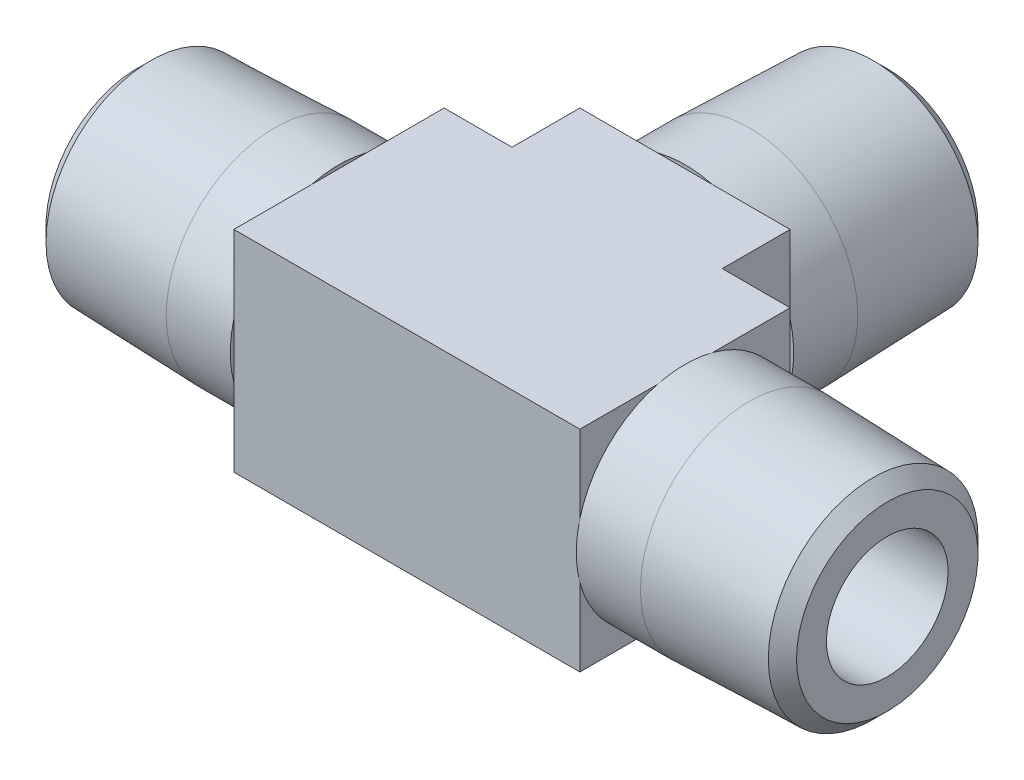
ISO-10303-21;
HEADER;
FILE_DESCRIPTION(('STEP AP214'),'2;1');
FILE_NAME('part.step','',(''),(''),'','','');
FILE_SCHEMA(('AUTOMOTIVE_DESIGN { 1 0 10303 214 1 1 1 1 }'));
ENDSEC;
DATA;
#1=APPLICATION_CONTEXT('core data for automotive mechanical design processes');
#2=APPLICATION_PROTOCOL_DEFINITION('international standard','automotive_design',2000,#1);
#3=PRODUCT_CONTEXT('',#1,'mechanical');
#4=PRODUCT('Part','Part','',(#3));
#5=PRODUCT_RELATED_PRODUCT_CATEGORY('part','',(#4));
#6=PRODUCT_DEFINITION_FORMATION('','',#4);
#7=PRODUCT_DEFINITION_CONTEXT('part definition',#1,'design');
#8=PRODUCT_DEFINITION('design','',#6,#7);
#9=PRODUCT_DEFINITION_SHAPE('','',#8);
#10=(LENGTH_UNIT() NAMED_UNIT(*) SI_UNIT(.MILLI.,.METRE.));
#11=(NAMED_UNIT(*) PLANE_ANGLE_UNIT() SI_UNIT($,.RADIAN.));
#12=(NAMED_UNIT(*) SI_UNIT($,.STERADIAN.) SOLID_ANGLE_UNIT());
#13=UNCERTAINTY_MEASURE_WITH_UNIT(LENGTH_MEASURE(1.E-05),#10,'distance_accuracy_value','');
#14=(GEOMETRIC_REPRESENTATION_CONTEXT(3) GLOBAL_UNCERTAINTY_ASSIGNED_CONTEXT((#13)) GLOBAL_UNIT_ASSIGNED_CONTEXT((#10,
#11,#12)) REPRESENTATION_CONTEXT('',''));
#15=CARTESIAN_POINT('',(0.,0.,0.));
#16=DIRECTION('',(0.,0.,1.));
#17=DIRECTION('',(1.,0.,0.));
#18=AXIS2_PLACEMENT_3D('',#15,#16,#17);
#19=CARTESIAN_POINT('',(26.51125,10.31875,0.));
#20=DIRECTION('',(-1.,0.,0.));
#21=DIRECTION('',(0.,0.,1.));
#22=AXIS2_PLACEMENT_3D('',#19,#20,#21);
#23=PLANE('',#22);
#24=DIRECTION('',(0.,1.,0.));
#25=VECTOR('',#24,1.);
#26=CARTESIAN_POINT('',(26.51125,10.31875,-10.31875));
#27=LINE('',#26,#25);
#28=CARTESIAN_POINT('',(26.51125,10.31875,-10.31875));
#29=VERTEX_POINT('',#28);
#30=CARTESIAN_POINT('',(26.51125,-10.31875,-10.31875));
#31=VERTEX_POINT('',#30);
#32=EDGE_CURVE('E131',#29,#31,#27,.F.);
#33=ORIENTED_EDGE('',*,*,#32,.F.);
#34=DIRECTION('',(0.,0.,1.));
#35=VECTOR('',#34,1.);
#36=CARTESIAN_POINT('',(26.51125,10.31875,10.31875));
#37=LINE('',#36,#35);
#38=CARTESIAN_POINT('',(26.51125,10.31875,-16.9799));
#39=VERTEX_POINT('',#38);
#40=EDGE_CURVE('E293',#39,#29,#37,.T.);
#41=ORIENTED_EDGE('',*,*,#40,.F.);
#42=DIRECTION('',(0.,1.,0.));
#43=VECTOR('',#42,1.);
#44=CARTESIAN_POINT('',(26.51125,0.,-16.9799));
#45=LINE('',#44,#43);
#46=CARTESIAN_POINT('',(26.51125,2.70732754529258,-16.9799));
#47=VERTEX_POINT('',#46);
#48=EDGE_CURVE('E124',#47,#39,#45,.T.);
#49=ORIENTED_EDGE('',*,*,#48,.F.);
#50=DIRECTION('',(0.,1.,0.));
#51=VECTOR('',#50,1.);
#52=CARTESIAN_POINT('',(26.51125,0.,-16.9799));
#53=LINE('',#52,#51);
#54=CARTESIAN_POINT('',(26.51125,-2.70732754529258,-16.9799));
#55=VERTEX_POINT('',#54);
#56=EDGE_CURVE('E305',#55,#47,#53,.T.);
#57=ORIENTED_EDGE('',*,*,#56,.F.);
#58=DIRECTION('',(0.,1.,0.));
#59=VECTOR('',#58,1.);
#60=CARTESIAN_POINT('',(26.51125,0.,-16.9799));
#61=LINE('',#60,#59);
#62=CARTESIAN_POINT('',(26.51125,-10.31875,-16.9799));
#63=VERTEX_POINT('',#62);
#64=EDGE_CURVE('E308',#63,#55,#61,.T.);
#65=ORIENTED_EDGE('',*,*,#64,.F.);
#66=DIRECTION('',(0.,0.,1.));
#67=VECTOR('',#66,1.);
#68=CARTESIAN_POINT('',(26.51125,-10.31875,-10.31875));
#69=LINE('',#68,#67);
#70=EDGE_CURVE('E292',#31,#63,#69,.F.);
#71=ORIENTED_EDGE('',*,*,#70,.F.);
#72=EDGE_LOOP('',(#33,#41,#49,#57,#65,#71));
#73=FACE_BOUND('',#72,.T.);
#74=ADVANCED_FACE('F17',(#73),#23,.T.);
#75=CARTESIAN_POINT('',(47.14875,-10.31875,0.));
#76=DIRECTION('',(1.,0.,0.));
#77=DIRECTION('',(0.,0.,-1.));
#78=AXIS2_PLACEMENT_3D('',#75,#76,#77);
#79=PLANE('',#78);
#80=DIRECTION('',(0.,1.,0.));
#81=VECTOR('',#80,1.);
#82=CARTESIAN_POINT('',(47.14875,0.,-16.9799));
#83=LINE('',#82,#81);
#84=CARTESIAN_POINT('',(47.14875,10.31875,-16.9799));
#85=VERTEX_POINT('',#84);
#86=CARTESIAN_POINT('',(47.14875,2.70732754529258,-16.9799));
#87=VERTEX_POINT('',#86);
#88=EDGE_CURVE('E162',#85,#87,#83,.F.);
#89=ORIENTED_EDGE('',*,*,#88,.F.);
#90=DIRECTION('',(0.,0.,1.));
#91=VECTOR('',#90,1.);
#92=CARTESIAN_POINT('',(47.14875,10.31875,10.31875));
#93=LINE('',#92,#91);
#94=CARTESIAN_POINT('',(47.14875,10.31875,-10.31875));
#95=VERTEX_POINT('',#94);
#96=EDGE_CURVE('E146',#95,#85,#93,.F.);
#97=ORIENTED_EDGE('',*,*,#96,.F.);
#98=DIRECTION('',(0.,1.,0.));
#99=VECTOR('',#98,1.);
#100=CARTESIAN_POINT('',(47.14875,10.31875,-10.31875));
#101=LINE('',#100,#99);
#102=CARTESIAN_POINT('',(47.14875,-10.31875,-10.31875));
#103=VERTEX_POINT('',#102);
#104=EDGE_CURVE('E275',#103,#95,#101,.T.);
#105=ORIENTED_EDGE('',*,*,#104,.F.);
#106=DIRECTION('',(0.,0.,1.));
#107=VECTOR('',#106,1.);
#108=CARTESIAN_POINT('',(47.14875,-10.31875,-10.31875));
#109=LINE('',#108,#107);
#110=CARTESIAN_POINT('',(47.14875,-10.31875,-16.9799));
#111=VERTEX_POINT('',#110);
#112=EDGE_CURVE('E286',#111,#103,#109,.T.);
#113=ORIENTED_EDGE('',*,*,#112,.F.);
#114=DIRECTION('',(0.,1.,0.));
#115=VECTOR('',#114,1.);
#116=CARTESIAN_POINT('',(47.14875,0.,-16.9799));
#117=LINE('',#116,#115);
#118=CARTESIAN_POINT('',(47.14875,-2.70732754529259,-16.9799));
#119=VERTEX_POINT('',#118);
#120=EDGE_CURVE('E310',#119,#111,#117,.F.);
#121=ORIENTED_EDGE('',*,*,#120,.F.);
#122=DIRECTION('',(0.,1.,0.));
#123=VECTOR('',#122,1.);
#124=CARTESIAN_POINT('',(47.14875,0.,-16.9799));
#125=LINE('',#124,#123);
#126=EDGE_CURVE('E165',#87,#119,#125,.F.);
#127=ORIENTED_EDGE('',*,*,#126,.F.);
#128=EDGE_LOOP('',(#89,#97,#105,#113,#121,#127));
#129=FACE_BOUND('',#128,.T.);
#130=ADVANCED_FACE('F163',(#129),#79,.T.);
#131=CARTESIAN_POINT('',(41.989375,0.,-16.9799));
#132=DIRECTION('',(0.,0.,-1.));
#133=DIRECTION('',(-1.,0.,0.));
#134=AXIS2_PLACEMENT_3D('',#131,#132,#133);
#135=PLANE('',#134);
#136=ORIENTED_EDGE('',*,*,#48,.T.);
#137=DIRECTION('',(-1.,0.,0.));
#138=VECTOR('',#137,1.);
#139=CARTESIAN_POINT('',(19.8501,10.31875,-16.9799));
#140=LINE('',#139,#138);
#141=CARTESIAN_POINT('',(34.1226724547074,10.31875,-16.9799));
#142=VERTEX_POINT('',#141);
#143=EDGE_CURVE('E173',#142,#39,#140,.T.);
#144=ORIENTED_EDGE('',*,*,#143,.F.);
#145=CARTESIAN_POINT('',(36.83,0.,-16.9799));
#146=DIRECTION('',(0.,0.,1.));
#147=DIRECTION('',(1.,0.,0.));
#148=AXIS2_PLACEMENT_3D('',#145,#146,#147);
#149=CIRCLE('',#148,10.668);
#150=EDGE_CURVE('E20',#47,#142,#149,.F.);
#151=ORIENTED_EDGE('',*,*,#150,.F.);
#152=EDGE_LOOP('',(#136,#144,#151));
#153=FACE_BOUND('',#152,.T.);
#154=ADVANCED_FACE('F985',(#153),#135,.T.);
#155=CARTESIAN_POINT('',(31.496,0.,-16.9799));
#156=DIRECTION('',(0.,0.,1.));
#157=DIRECTION('',(1.,0.,0.));
#158=AXIS2_PLACEMENT_3D('',#155,#156,#157);
#159=PLANE('',#158);
#160=DIRECTION('',(-1.,0.,0.));
#161=VECTOR('',#160,1.);
#162=CARTESIAN_POINT('',(19.8501,10.31875,-16.9799));
#163=LINE('',#162,#161);
#164=CARTESIAN_POINT('',(39.5373275452926,10.31875,-16.9799));
#165=VERTEX_POINT('',#164);
#166=EDGE_CURVE('E116',#165,#142,#163,.T.);
#167=ORIENTED_EDGE('',*,*,#166,.F.);
#168=CARTESIAN_POINT('',(36.83,0.,-16.9799));
#169=DIRECTION('',(0.,0.,1.));
#170=DIRECTION('',(1.,0.,0.));
#171=AXIS2_PLACEMENT_3D('',#168,#169,#170);
#172=CIRCLE('',#171,10.668);
#173=EDGE_CURVE('E265',#142,#165,#172,.F.);
#174=ORIENTED_EDGE('',*,*,#173,.F.);
#175=EDGE_LOOP('',(#167,#174));
#176=FACE_BOUND('',#175,.T.);
#177=ADVANCED_FACE('F989',(#176),#159,.T.);
#178=CARTESIAN_POINT('',(41.989375,0.,-16.9799));
#179=DIRECTION('',(0.,0.,-1.));
#180=DIRECTION('',(-1.,0.,0.));
#181=AXIS2_PLACEMENT_3D('',#178,#179,#180);
#182=PLANE('',#181);
#183=DIRECTION('',(-1.,0.,0.));
#184=VECTOR('',#183,1.);
#185=CARTESIAN_POINT('',(19.8501,10.31875,-16.9799));
#186=LINE('',#185,#184);
#187=EDGE_CURVE('E150',#85,#165,#186,.T.);
#188=ORIENTED_EDGE('',*,*,#187,.F.);
#189=ORIENTED_EDGE('',*,*,#88,.T.);
#190=CARTESIAN_POINT('',(36.83,0.,-16.9799));
#191=DIRECTION('',(0.,0.,1.));
#192=DIRECTION('',(1.,0.,0.));
#193=AXIS2_PLACEMENT_3D('',#190,#191,#192);
#194=CIRCLE('',#193,10.668);
#195=EDGE_CURVE('E170',#165,#87,#194,.F.);
#196=ORIENTED_EDGE('',*,*,#195,.F.);
#197=EDGE_LOOP('',(#188,#189,#196));
#198=FACE_BOUND('',#197,.T.);
#199=ADVANCED_FACE('F169',(#198),#182,.T.);
#200=CARTESIAN_POINT('',(31.496,0.,-16.9799));
#201=DIRECTION('',(0.,0.,1.));
#202=DIRECTION('',(1.,0.,0.));
#203=AXIS2_PLACEMENT_3D('',#200,#201,#202);
#204=PLANE('',#203);
#205=CARTESIAN_POINT('',(36.83,0.,-16.9799));
#206=DIRECTION('',(0.,0.,1.));
#207=DIRECTION('',(1.,0.,0.));
#208=AXIS2_PLACEMENT_3D('',#205,#206,#207);
#209=CIRCLE('',#208,10.668);
#210=EDGE_CURVE('E262',#87,#119,#209,.F.);
#211=ORIENTED_EDGE('',*,*,#210,.F.);
#212=ORIENTED_EDGE('',*,*,#126,.T.);
#213=EDGE_LOOP('',(#211,#212));
#214=FACE_BOUND('',#213,.T.);
#215=ADVANCED_FACE('F667',(#214),#204,.T.);
#216=CARTESIAN_POINT('',(41.989375,0.,-16.9799));
#217=DIRECTION('',(0.,0.,-1.));
#218=DIRECTION('',(-1.,0.,0.));
#219=AXIS2_PLACEMENT_3D('',#216,#217,#218);
#220=PLANE('',#219);
#221=ORIENTED_EDGE('',*,*,#120,.T.);
#222=DIRECTION('',(1.,0.,0.));
#223=VECTOR('',#222,1.);
#224=CARTESIAN_POINT('',(19.8501,-10.31875,-16.9799));
#225=LINE('',#224,#223);
#226=CARTESIAN_POINT('',(39.5373275452926,-10.31875,-16.9799));
#227=VERTEX_POINT('',#226);
#228=EDGE_CURVE('E324',#227,#111,#225,.T.);
#229=ORIENTED_EDGE('',*,*,#228,.F.);
#230=CARTESIAN_POINT('',(36.83,0.,-16.9799));
#231=DIRECTION('',(0.,0.,1.));
#232=DIRECTION('',(1.,0.,0.));
#233=AXIS2_PLACEMENT_3D('',#230,#231,#232);
#234=CIRCLE('',#233,10.668);
#235=EDGE_CURVE('E259',#119,#227,#234,.F.);
#236=ORIENTED_EDGE('',*,*,#235,.F.);
#237=EDGE_LOOP('',(#221,#229,#236));
#238=FACE_BOUND('',#237,.T.);
#239=ADVANCED_FACE('F671',(#238),#220,.T.);
#240=CARTESIAN_POINT('',(31.496,0.,-16.9799));
#241=DIRECTION('',(0.,0.,1.));
#242=DIRECTION('',(1.,0.,0.));
#243=AXIS2_PLACEMENT_3D('',#240,#241,#242);
#244=PLANE('',#243);
#245=DIRECTION('',(1.,0.,0.));
#246=VECTOR('',#245,1.);
#247=CARTESIAN_POINT('',(19.8501,-10.31875,-16.9799));
#248=LINE('',#247,#246);
#249=CARTESIAN_POINT('',(34.1226724547074,-10.31875,-16.9799));
#250=VERTEX_POINT('',#249);
#251=EDGE_CURVE('E341',#250,#227,#248,.T.);
#252=ORIENTED_EDGE('',*,*,#251,.F.);
#253=CARTESIAN_POINT('',(36.83,0.,-16.9799));
#254=DIRECTION('',(0.,0.,1.));
#255=DIRECTION('',(1.,0.,0.));
#256=AXIS2_PLACEMENT_3D('',#253,#254,#255);
#257=CIRCLE('',#256,10.668);
#258=EDGE_CURVE('E256',#227,#250,#257,.F.);
#259=ORIENTED_EDGE('',*,*,#258,.F.);
#260=EDGE_LOOP('',(#252,#259));
#261=FACE_BOUND('',#260,.T.);
#262=ADVANCED_FACE('F732',(#261),#244,.T.);
#263=CARTESIAN_POINT('',(41.989375,0.,-16.9799));
#264=DIRECTION('',(0.,0.,-1.));
#265=DIRECTION('',(-1.,0.,0.));
#266=AXIS2_PLACEMENT_3D('',#263,#264,#265);
#267=PLANE('',#266);
#268=DIRECTION('',(1.,0.,0.));
#269=VECTOR('',#268,1.);
#270=CARTESIAN_POINT('',(19.8501,-10.31875,-16.9799));
#271=LINE('',#270,#269);
#272=EDGE_CURVE('E336',#63,#250,#271,.T.);
#273=ORIENTED_EDGE('',*,*,#272,.F.);
#274=ORIENTED_EDGE('',*,*,#64,.T.);
#275=CARTESIAN_POINT('',(36.83,0.,-16.9799));
#276=DIRECTION('',(0.,0.,1.));
#277=DIRECTION('',(1.,0.,0.));
#278=AXIS2_PLACEMENT_3D('',#275,#276,#277);
#279=CIRCLE('',#278,10.668);
#280=EDGE_CURVE('E253',#250,#55,#279,.F.);
#281=ORIENTED_EDGE('',*,*,#280,.F.);
#282=EDGE_LOOP('',(#273,#274,#281));
#283=FACE_BOUND('',#282,.T.);
#284=ADVANCED_FACE('F727',(#283),#267,.T.);
#285=CARTESIAN_POINT('',(31.496,0.,-16.9799));
#286=DIRECTION('',(0.,0.,1.));
#287=DIRECTION('',(1.,0.,0.));
#288=AXIS2_PLACEMENT_3D('',#285,#286,#287);
#289=PLANE('',#288);
#290=ORIENTED_EDGE('',*,*,#56,.T.);
#291=CARTESIAN_POINT('',(36.83,0.,-16.9799));
#292=DIRECTION('',(0.,0.,1.));
#293=DIRECTION('',(1.,0.,0.));
#294=AXIS2_PLACEMENT_3D('',#291,#292,#293);
#295=CIRCLE('',#294,10.668);
#296=EDGE_CURVE('E249',#55,#47,#295,.F.);
#297=ORIENTED_EDGE('',*,*,#296,.F.);
#298=EDGE_LOOP('',(#290,#297));
#299=FACE_BOUND('',#298,.T.);
#300=ADVANCED_FACE('F731',(#299),#289,.T.);
#301=CARTESIAN_POINT('',(19.8501,10.31875,-10.31875));
#302=DIRECTION('',(0.,0.,-1.));
#303=DIRECTION('',(-1.,0.,0.));
#304=AXIS2_PLACEMENT_3D('',#301,#302,#303);
#305=PLANE('',#304);
#306=DIRECTION('',(0.,1.,0.));
#307=VECTOR('',#306,1.);
#308=CARTESIAN_POINT('',(19.8501,0.,-10.31875));
#309=LINE('',#308,#307);
#310=CARTESIAN_POINT('',(19.8501,10.31875,-10.31875));
#311=VERTEX_POINT('',#310);
#312=CARTESIAN_POINT('',(19.8501,2.70732754529258,-10.31875));
#313=VERTEX_POINT('',#312);
#314=EDGE_CURVE('E359',#311,#313,#309,.F.);
#315=ORIENTED_EDGE('',*,*,#314,.F.);
#316=DIRECTION('',(-1.,0.,0.));
#317=VECTOR('',#316,1.);
#318=CARTESIAN_POINT('',(19.8501,10.31875,-10.31875));
#319=LINE('',#318,#317);
#320=EDGE_CURVE('E158',#29,#311,#319,.T.);
#321=ORIENTED_EDGE('',*,*,#320,.F.);
#322=ORIENTED_EDGE('',*,*,#32,.T.);
#323=DIRECTION('',(1.,0.,0.));
#324=VECTOR('',#323,1.);
#325=CARTESIAN_POINT('',(19.8501,-10.31875,-10.31875));
#326=LINE('',#325,#324);
#327=CARTESIAN_POINT('',(19.8501,-10.31875,-10.31875));
#328=VERTEX_POINT('',#327);
#329=EDGE_CURVE('E285',#328,#31,#326,.T.);
#330=ORIENTED_EDGE('',*,*,#329,.F.);
#331=DIRECTION('',(0.,1.,0.));
#332=VECTOR('',#331,1.);
#333=CARTESIAN_POINT('',(19.8501,0.,-10.31875));
#334=LINE('',#333,#332);
#335=CARTESIAN_POINT('',(19.8501,-2.70732754529259,-10.31875));
#336=VERTEX_POINT('',#335);
#337=EDGE_CURVE('E367',#336,#328,#334,.F.);
#338=ORIENTED_EDGE('',*,*,#337,.F.);
#339=DIRECTION('',(0.,1.,0.));
#340=VECTOR('',#339,1.);
#341=CARTESIAN_POINT('',(19.8501,0.,-10.31875));
#342=LINE('',#341,#340);
#343=EDGE_CURVE('E361',#313,#336,#342,.F.);
#344=ORIENTED_EDGE('',*,*,#343,.F.);
#345=EDGE_LOOP('',(#315,#321,#322,#330,#338,#344));
#346=FACE_BOUND('',#345,.T.);
#347=ADVANCED_FACE('F356',(#346),#305,.T.);
#348=CARTESIAN_POINT('',(19.8501,10.31875,10.31875));
#349=DIRECTION('',(0.,1.,0.));
#350=DIRECTION('',(-1.,0.,0.));
#351=AXIS2_PLACEMENT_3D('',#348,#349,#350);
#352=PLANE('',#351);
#353=ORIENTED_EDGE('',*,*,#143,.T.);
#354=ORIENTED_EDGE('',*,*,#40,.T.);
#355=ORIENTED_EDGE('',*,*,#320,.T.);
#356=DIRECTION('',(0.,0.,1.));
#357=VECTOR('',#356,1.);
#358=CARTESIAN_POINT('',(19.8501,10.31875,-5.159375));
#359=LINE('',#358,#357);
#360=CARTESIAN_POINT('',(19.8501,10.31875,-2.70732754529259));
#361=VERTEX_POINT('',#360);
#362=EDGE_CURVE('E365',#361,#311,#359,.F.);
#363=ORIENTED_EDGE('',*,*,#362,.F.);
#364=DIRECTION('',(0.,0.,-1.));
#365=VECTOR('',#364,1.);
#366=CARTESIAN_POINT('',(19.8501,10.31875,5.334));
#367=LINE('',#366,#365);
#368=CARTESIAN_POINT('',(19.8501,10.31875,2.70732754529259));
#369=VERTEX_POINT('',#368);
#370=EDGE_CURVE('E369',#369,#361,#367,.T.);
#371=ORIENTED_EDGE('',*,*,#370,.F.);
#372=DIRECTION('',(0.,0.,1.));
#373=VECTOR('',#372,1.);
#374=CARTESIAN_POINT('',(19.8501,10.31875,-5.159375));
#375=LINE('',#374,#373);
#376=CARTESIAN_POINT('',(19.8501,10.31875,10.31875));
#377=VERTEX_POINT('',#376);
#378=EDGE_CURVE('E378',#377,#369,#375,.F.);
#379=ORIENTED_EDGE('',*,*,#378,.F.);
#380=DIRECTION('',(1.,0.,0.));
#381=VECTOR('',#380,1.);
#382=CARTESIAN_POINT('',(19.8501,10.31875,10.31875));
#383=LINE('',#382,#381);
#384=CARTESIAN_POINT('',(53.8099,10.31875,10.31875));
#385=VERTEX_POINT('',#384);
#386=EDGE_CURVE('E289',#385,#377,#383,.F.);
#387=ORIENTED_EDGE('',*,*,#386,.F.);
#388=DIRECTION('',(0.,0.,-1.));
#389=VECTOR('',#388,1.);
#390=CARTESIAN_POINT('',(53.8099,10.31875,-5.159375));
#391=LINE('',#390,#389);
#392=CARTESIAN_POINT('',(53.8099,10.31875,2.70732754529259));
#393=VERTEX_POINT('',#392);
#394=EDGE_CURVE('E1110',#393,#385,#391,.F.);
#395=ORIENTED_EDGE('',*,*,#394,.F.);
#396=DIRECTION('',(0.,0.,1.));
#397=VECTOR('',#396,1.);
#398=CARTESIAN_POINT('',(53.8099,10.31875,-5.334));
#399=LINE('',#398,#397);
#400=CARTESIAN_POINT('',(53.8099,10.31875,-2.70732754529259));
#401=VERTEX_POINT('',#400);
#402=EDGE_CURVE('E1145',#401,#393,#399,.T.);
#403=ORIENTED_EDGE('',*,*,#402,.F.);
#404=DIRECTION('',(0.,0.,-1.));
#405=VECTOR('',#404,1.);
#406=CARTESIAN_POINT('',(53.8099,10.31875,-5.159375));
#407=LINE('',#406,#405);
#408=CARTESIAN_POINT('',(53.8099,10.31875,-10.31875));
#409=VERTEX_POINT('',#408);
#410=EDGE_CURVE('E413',#409,#401,#407,.F.);
#411=ORIENTED_EDGE('',*,*,#410,.F.);
#412=DIRECTION('',(-1.,0.,0.));
#413=VECTOR('',#412,1.);
#414=CARTESIAN_POINT('',(19.8501,10.31875,-10.31875));
#415=LINE('',#414,#413);
#416=EDGE_CURVE('E155',#95,#409,#415,.F.);
#417=ORIENTED_EDGE('',*,*,#416,.F.);
#418=ORIENTED_EDGE('',*,*,#96,.T.);
#419=ORIENTED_EDGE('',*,*,#187,.T.);
#420=ORIENTED_EDGE('',*,*,#166,.T.);
#421=EDGE_LOOP('',(#353,#354,#355,#363,#371,#379,#387,#395,#403,#411,#417,#418,#419,#420));
#422=FACE_BOUND('',#421,.T.);
#423=ADVANCED_FACE('F148',(#422),#352,.T.);
#424=CARTESIAN_POINT('',(19.8501,-10.31875,10.31875));
#425=DIRECTION('',(0.,0.,1.));
#426=DIRECTION('',(1.,0.,0.));
#427=AXIS2_PLACEMENT_3D('',#424,#425,#426);
#428=PLANE('',#427);
#429=DIRECTION('',(0.,1.,0.));
#430=VECTOR('',#429,1.);
#431=CARTESIAN_POINT('',(53.8099,0.,10.31875));
#432=LINE('',#431,#430);
#433=CARTESIAN_POINT('',(53.8099,2.70732754529258,10.31875));
#434=VERTEX_POINT('',#433);
#435=EDGE_CURVE('E1140',#385,#434,#432,.F.);
#436=ORIENTED_EDGE('',*,*,#435,.F.);
#437=ORIENTED_EDGE('',*,*,#386,.T.);
#438=DIRECTION('',(0.,1.,0.));
#439=VECTOR('',#438,1.);
#440=CARTESIAN_POINT('',(19.8501,0.,10.31875));
#441=LINE('',#440,#439);
#442=CARTESIAN_POINT('',(19.8501,2.70732754529259,10.31875));
#443=VERTEX_POINT('',#442);
#444=EDGE_CURVE('E252',#443,#377,#441,.T.);
#445=ORIENTED_EDGE('',*,*,#444,.F.);
#446=DIRECTION('',(0.,1.,0.));
#447=VECTOR('',#446,1.);
#448=CARTESIAN_POINT('',(19.8501,0.,10.31875));
#449=LINE('',#448,#447);
#450=CARTESIAN_POINT('',(19.8501,-2.70732754529259,10.31875));
#451=VERTEX_POINT('',#450);
#452=EDGE_CURVE('E406',#451,#443,#449,.T.);
#453=ORIENTED_EDGE('',*,*,#452,.F.);
#454=DIRECTION('',(0.,1.,0.));
#455=VECTOR('',#454,1.);
#456=CARTESIAN_POINT('',(19.8501,0.,10.31875));
#457=LINE('',#456,#455);
#458=CARTESIAN_POINT('',(19.8501,-10.31875,10.31875));
#459=VERTEX_POINT('',#458);
#460=EDGE_CURVE('E410',#459,#451,#457,.T.);
#461=ORIENTED_EDGE('',*,*,#460,.F.);
#462=DIRECTION('',(1.,0.,0.));
#463=VECTOR('',#462,1.);
#464=CARTESIAN_POINT('',(19.8501,-10.31875,10.31875));
#465=LINE('',#464,#463);
#466=CARTESIAN_POINT('',(53.8099,-10.31875,10.31875));
#467=VERTEX_POINT('',#466);
#468=EDGE_CURVE('E282',#467,#459,#465,.F.);
#469=ORIENTED_EDGE('',*,*,#468,.F.);
#470=DIRECTION('',(0.,1.,0.));
#471=VECTOR('',#470,1.);
#472=CARTESIAN_POINT('',(53.8099,0.,10.31875));
#473=LINE('',#472,#471);
#474=CARTESIAN_POINT('',(53.8099,-2.70732754529258,10.31875));
#475=VERTEX_POINT('',#474);
#476=EDGE_CURVE('E1132',#475,#467,#473,.F.);
#477=ORIENTED_EDGE('',*,*,#476,.F.);
#478=DIRECTION('',(0.,1.,0.));
#479=VECTOR('',#478,1.);
#480=CARTESIAN_POINT('',(53.8099,0.,10.31875));
#481=LINE('',#480,#479);
#482=EDGE_CURVE('E1136',#434,#475,#481,.F.);
#483=ORIENTED_EDGE('',*,*,#482,.F.);
#484=EDGE_LOOP('',(#436,#437,#445,#453,#461,#469,#477,#483));
#485=FACE_BOUND('',#484,.T.);
#486=ADVANCED_FACE('F685',(#485),#428,.T.);
#487=CARTESIAN_POINT('',(19.8501,-10.31875,-10.31875));
#488=DIRECTION('',(0.,-1.,0.));
#489=DIRECTION('',(1.,0.,0.));
#490=AXIS2_PLACEMENT_3D('',#487,#488,#489);
#491=PLANE('',#490);
#492=DIRECTION('',(0.,0.,1.));
#493=VECTOR('',#492,1.);
#494=CARTESIAN_POINT('',(19.8501,-10.31875,-5.159375));
#495=LINE('',#494,#493);
#496=CARTESIAN_POINT('',(19.8501,-10.31875,-2.70732754529259));
#497=VERTEX_POINT('',#496);
#498=EDGE_CURVE('E428',#328,#497,#495,.T.);
#499=ORIENTED_EDGE('',*,*,#498,.F.);
#500=ORIENTED_EDGE('',*,*,#329,.T.);
#501=ORIENTED_EDGE('',*,*,#70,.T.);
#502=ORIENTED_EDGE('',*,*,#272,.T.);
#503=ORIENTED_EDGE('',*,*,#251,.T.);
#504=ORIENTED_EDGE('',*,*,#228,.T.);
#505=ORIENTED_EDGE('',*,*,#112,.T.);
#506=DIRECTION('',(-1.,0.,0.));
#507=VECTOR('',#506,1.);
#508=CARTESIAN_POINT('',(19.8501,-10.31875,-10.31875));
#509=LINE('',#508,#507);
#510=CARTESIAN_POINT('',(53.8099,-10.31875,-10.31875));
#511=VERTEX_POINT('',#510);
#512=EDGE_CURVE('E268',#511,#103,#509,.T.);
#513=ORIENTED_EDGE('',*,*,#512,.F.);
#514=DIRECTION('',(0.,0.,-1.));
#515=VECTOR('',#514,1.);
#516=CARTESIAN_POINT('',(53.8099,-10.31875,-5.159375));
#517=LINE('',#516,#515);
#518=CARTESIAN_POINT('',(53.8099,-10.31875,-2.70732754529258));
#519=VERTEX_POINT('',#518);
#520=EDGE_CURVE('E1117',#519,#511,#517,.T.);
#521=ORIENTED_EDGE('',*,*,#520,.F.);
#522=DIRECTION('',(0.,0.,1.));
#523=VECTOR('',#522,1.);
#524=CARTESIAN_POINT('',(53.8099,-10.31875,-5.334));
#525=LINE('',#524,#523);
#526=CARTESIAN_POINT('',(53.8099,-10.31875,2.70732754529258));
#527=VERTEX_POINT('',#526);
#528=EDGE_CURVE('E1120',#527,#519,#525,.F.);
#529=ORIENTED_EDGE('',*,*,#528,.F.);
#530=DIRECTION('',(0.,0.,-1.));
#531=VECTOR('',#530,1.);
#532=CARTESIAN_POINT('',(53.8099,-10.31875,-5.159375));
#533=LINE('',#532,#531);
#534=EDGE_CURVE('E1124',#467,#527,#533,.T.);
#535=ORIENTED_EDGE('',*,*,#534,.F.);
#536=ORIENTED_EDGE('',*,*,#468,.T.);
#537=DIRECTION('',(0.,0.,1.));
#538=VECTOR('',#537,1.);
#539=CARTESIAN_POINT('',(19.8501,-10.31875,-5.159375));
#540=LINE('',#539,#538);
#541=CARTESIAN_POINT('',(19.8501,-10.31875,2.70732754529259));
#542=VERTEX_POINT('',#541);
#543=EDGE_CURVE('E415',#542,#459,#540,.T.);
#544=ORIENTED_EDGE('',*,*,#543,.F.);
#545=DIRECTION('',(0.,0.,-1.));
#546=VECTOR('',#545,1.);
#547=CARTESIAN_POINT('',(19.8501,-10.31875,5.334));
#548=LINE('',#547,#546);
#549=EDGE_CURVE('E424',#497,#542,#548,.F.);
#550=ORIENTED_EDGE('',*,*,#549,.F.);
#551=EDGE_LOOP('',(#499,#500,#501,#502,#503,#504,#505,#513,#521,#529,#535,#536,#544,#550));
#552=FACE_BOUND('',#551,.T.);
#553=ADVANCED_FACE('F443',(#552),#491,.T.);
#554=CARTESIAN_POINT('',(19.8501,10.31875,-10.31875));
#555=DIRECTION('',(0.,0.,-1.));
#556=DIRECTION('',(-1.,0.,0.));
#557=AXIS2_PLACEMENT_3D('',#554,#555,#556);
#558=PLANE('',#557);
#559=DIRECTION('',(0.,1.,0.));
#560=VECTOR('',#559,1.);
#561=CARTESIAN_POINT('',(53.8099,0.,-10.31875));
#562=LINE('',#561,#560);
#563=CARTESIAN_POINT('',(53.8099,-2.70732754529259,-10.31875));
#564=VERTEX_POINT('',#563);
#565=EDGE_CURVE('E1118',#511,#564,#562,.T.);
#566=ORIENTED_EDGE('',*,*,#565,.F.);
#567=ORIENTED_EDGE('',*,*,#512,.T.);
#568=ORIENTED_EDGE('',*,*,#104,.T.);
#569=ORIENTED_EDGE('',*,*,#416,.T.);
#570=DIRECTION('',(0.,1.,0.));
#571=VECTOR('',#570,1.);
#572=CARTESIAN_POINT('',(53.8099,0.,-10.31875));
#573=LINE('',#572,#571);
#574=CARTESIAN_POINT('',(53.8099,2.70732754529259,-10.31875));
#575=VERTEX_POINT('',#574);
#576=EDGE_CURVE('E409',#575,#409,#573,.T.);
#577=ORIENTED_EDGE('',*,*,#576,.F.);
#578=DIRECTION('',(0.,1.,0.));
#579=VECTOR('',#578,1.);
#580=CARTESIAN_POINT('',(53.8099,0.,-10.31875));
#581=LINE('',#580,#579);
#582=EDGE_CURVE('E1122',#564,#575,#581,.T.);
#583=ORIENTED_EDGE('',*,*,#582,.F.);
#584=EDGE_LOOP('',(#566,#567,#568,#569,#577,#583));
#585=FACE_BOUND('',#584,.T.);
#586=ADVANCED_FACE('F684',(#585),#558,.T.);
#587=CARTESIAN_POINT('',(36.83,0.,-20.12696));
#588=DIRECTION('',(0.,0.,1.));
#589=DIRECTION('',(1.,0.,0.));
#590=AXIS2_PLACEMENT_3D('',#587,#588,#589);
#591=CYLINDRICAL_SURFACE('',#590,10.668);
#592=CARTESIAN_POINT('',(36.83,0.,-23.27402));
#593=DIRECTION('',(0.,0.,1.));
#594=DIRECTION('',(-1.,0.,0.));
#595=AXIS2_PLACEMENT_3D('',#592,#593,#594);
#596=CIRCLE('',#595,10.668);
#597=CARTESIAN_POINT('',(26.162,0.,-23.27402));
#598=VERTEX_POINT('',#597);
#599=EDGE_CURVE('E248',#598,#598,#596,.F.);
#600=ORIENTED_EDGE('',*,*,#599,.F.);
#601=EDGE_LOOP('',(#600));
#602=FACE_BOUND('',#601,.T.);
#603=ORIENTED_EDGE('',*,*,#280,.T.);
#604=ORIENTED_EDGE('',*,*,#296,.T.);
#605=ORIENTED_EDGE('',*,*,#150,.T.);
#606=ORIENTED_EDGE('',*,*,#173,.T.);
#607=ORIENTED_EDGE('',*,*,#195,.T.);
#608=ORIENTED_EDGE('',*,*,#210,.T.);
#609=ORIENTED_EDGE('',*,*,#235,.T.);
#610=ORIENTED_EDGE('',*,*,#258,.T.);
#611=EDGE_LOOP('',(#603,#604,#605,#606,#607,#608,#609,#610));
#612=FACE_BOUND('',#611,.T.);
#613=ADVANCED_FACE('F699',(#602,#612),#591,.T.);
#614=CARTESIAN_POINT('',(19.8501,0.,-5.159375));
#615=DIRECTION('',(-1.,0.,0.));
#616=DIRECTION('',(0.,0.,1.));
#617=AXIS2_PLACEMENT_3D('',#614,#615,#616);
#618=PLANE('',#617);
#619=ORIENTED_EDGE('',*,*,#444,.T.);
#620=ORIENTED_EDGE('',*,*,#378,.T.);
#621=CARTESIAN_POINT('',(19.8501,0.,0.));
#622=DIRECTION('',(1.,0.,0.));
#623=DIRECTION('',(0.,0.,-1.));
#624=AXIS2_PLACEMENT_3D('',#621,#622,#623);
#625=CIRCLE('',#624,10.668);
#626=EDGE_CURVE('E245',#443,#369,#625,.F.);
#627=ORIENTED_EDGE('',*,*,#626,.F.);
#628=EDGE_LOOP('',(#619,#620,#627));
#629=FACE_BOUND('',#628,.T.);
#630=ADVANCED_FACE('F388',(#629),#618,.T.);
#631=CARTESIAN_POINT('',(19.8501,0.,5.334));
#632=DIRECTION('',(1.,0.,0.));
#633=DIRECTION('',(0.,0.,-1.));
#634=AXIS2_PLACEMENT_3D('',#631,#632,#633);
#635=PLANE('',#634);
#636=ORIENTED_EDGE('',*,*,#370,.T.);
#637=CARTESIAN_POINT('',(19.8501,0.,0.));
#638=DIRECTION('',(1.,0.,0.));
#639=DIRECTION('',(0.,0.,-1.));
#640=AXIS2_PLACEMENT_3D('',#637,#638,#639);
#641=CIRCLE('',#640,10.668);
#642=EDGE_CURVE('E242',#369,#361,#641,.F.);
#643=ORIENTED_EDGE('',*,*,#642,.F.);
#644=EDGE_LOOP('',(#636,#643));
#645=FACE_BOUND('',#644,.T.);
#646=ADVANCED_FACE('F399',(#645),#635,.T.);
#647=CARTESIAN_POINT('',(19.8501,0.,-5.159375));
#648=DIRECTION('',(-1.,0.,0.));
#649=DIRECTION('',(0.,0.,1.));
#650=AXIS2_PLACEMENT_3D('',#647,#648,#649);
#651=PLANE('',#650);
#652=ORIENTED_EDGE('',*,*,#362,.T.);
#653=ORIENTED_EDGE('',*,*,#314,.T.);
#654=CARTESIAN_POINT('',(19.8501,0.,0.));
#655=DIRECTION('',(1.,0.,0.));
#656=DIRECTION('',(0.,0.,-1.));
#657=AXIS2_PLACEMENT_3D('',#654,#655,#656);
#658=CIRCLE('',#657,10.668);
#659=EDGE_CURVE('E239',#361,#313,#658,.F.);
#660=ORIENTED_EDGE('',*,*,#659,.F.);
#661=EDGE_LOOP('',(#652,#653,#660));
#662=FACE_BOUND('',#661,.T.);
#663=ADVANCED_FACE('F451',(#662),#651,.T.);
#664=CARTESIAN_POINT('',(19.8501,0.,5.334));
#665=DIRECTION('',(1.,0.,0.));
#666=DIRECTION('',(0.,0.,-1.));
#667=AXIS2_PLACEMENT_3D('',#664,#665,#666);
#668=PLANE('',#667);
#669=CARTESIAN_POINT('',(19.8501,0.,0.));
#670=DIRECTION('',(1.,0.,0.));
#671=DIRECTION('',(0.,0.,-1.));
#672=AXIS2_PLACEMENT_3D('',#669,#670,#671);
#673=CIRCLE('',#672,10.668);
#674=EDGE_CURVE('E236',#313,#336,#673,.F.);
#675=ORIENTED_EDGE('',*,*,#674,.F.);
#676=ORIENTED_EDGE('',*,*,#343,.T.);
#677=EDGE_LOOP('',(#675,#676));
#678=FACE_BOUND('',#677,.T.);
#679=ADVANCED_FACE('F449',(#678),#668,.T.);
#680=CARTESIAN_POINT('',(19.8501,0.,-5.159375));
#681=DIRECTION('',(-1.,0.,0.));
#682=DIRECTION('',(0.,0.,1.));
#683=AXIS2_PLACEMENT_3D('',#680,#681,#682);
#684=PLANE('',#683);
#685=ORIENTED_EDGE('',*,*,#337,.T.);
#686=ORIENTED_EDGE('',*,*,#498,.T.);
#687=CARTESIAN_POINT('',(19.8501,0.,0.));
#688=DIRECTION('',(1.,0.,0.));
#689=DIRECTION('',(0.,0.,-1.));
#690=AXIS2_PLACEMENT_3D('',#687,#688,#689);
#691=CIRCLE('',#690,10.668);
#692=EDGE_CURVE('E233',#336,#497,#691,.F.);
#693=ORIENTED_EDGE('',*,*,#692,.F.);
#694=EDGE_LOOP('',(#685,#686,#693));
#695=FACE_BOUND('',#694,.T.);
#696=ADVANCED_FACE('F436',(#695),#684,.T.);
#697=CARTESIAN_POINT('',(19.8501,0.,5.334));
#698=DIRECTION('',(1.,0.,0.));
#699=DIRECTION('',(0.,0.,-1.));
#700=AXIS2_PLACEMENT_3D('',#697,#698,#699);
#701=PLANE('',#700);
#702=ORIENTED_EDGE('',*,*,#549,.T.);
#703=CARTESIAN_POINT('',(19.8501,0.,0.));
#704=DIRECTION('',(1.,0.,0.));
#705=DIRECTION('',(0.,0.,-1.));
#706=AXIS2_PLACEMENT_3D('',#703,#704,#705);
#707=CIRCLE('',#706,10.668);
#708=EDGE_CURVE('E230',#497,#542,#707,.F.);
#709=ORIENTED_EDGE('',*,*,#708,.F.);
#710=EDGE_LOOP('',(#702,#709));
#711=FACE_BOUND('',#710,.T.);
#712=ADVANCED_FACE('F447',(#711),#701,.T.);
#713=CARTESIAN_POINT('',(19.8501,0.,-5.159375));
#714=DIRECTION('',(-1.,0.,0.));
#715=DIRECTION('',(0.,0.,1.));
#716=AXIS2_PLACEMENT_3D('',#713,#714,#715);
#717=PLANE('',#716);
#718=ORIENTED_EDGE('',*,*,#543,.T.);
#719=ORIENTED_EDGE('',*,*,#460,.T.);
#720=CARTESIAN_POINT('',(19.8501,0.,0.));
#721=DIRECTION('',(1.,0.,0.));
#722=DIRECTION('',(0.,0.,-1.));
#723=AXIS2_PLACEMENT_3D('',#720,#721,#722);
#724=CIRCLE('',#723,10.668);
#725=EDGE_CURVE('E227',#542,#451,#724,.F.);
#726=ORIENTED_EDGE('',*,*,#725,.F.);
#727=EDGE_LOOP('',(#718,#719,#726));
#728=FACE_BOUND('',#727,.T.);
#729=ADVANCED_FACE('F550',(#728),#717,.T.);
#730=CARTESIAN_POINT('',(19.8501,0.,5.334));
#731=DIRECTION('',(1.,0.,0.));
#732=DIRECTION('',(0.,0.,-1.));
#733=AXIS2_PLACEMENT_3D('',#730,#731,#732);
#734=PLANE('',#733);
#735=ORIENTED_EDGE('',*,*,#452,.T.);
#736=CARTESIAN_POINT('',(19.8501,0.,0.));
#737=DIRECTION('',(1.,0.,0.));
#738=DIRECTION('',(0.,0.,-1.));
#739=AXIS2_PLACEMENT_3D('',#736,#737,#738);
#740=CIRCLE('',#739,10.668);
#741=EDGE_CURVE('E225',#451,#443,#740,.F.);
#742=ORIENTED_EDGE('',*,*,#741,.F.);
#743=EDGE_LOOP('',(#735,#742));
#744=FACE_BOUND('',#743,.T.);
#745=ADVANCED_FACE('F407',(#744),#734,.T.);
#746=CARTESIAN_POINT('',(53.8099,0.,-5.159375));
#747=DIRECTION('',(1.,0.,0.));
#748=DIRECTION('',(0.,0.,-1.));
#749=AXIS2_PLACEMENT_3D('',#746,#747,#748);
#750=PLANE('',#749);
#751=ORIENTED_EDGE('',*,*,#576,.T.);
#752=ORIENTED_EDGE('',*,*,#410,.T.);
#753=CARTESIAN_POINT('',(53.8099,0.,0.));
#754=DIRECTION('',(-1.,0.,0.));
#755=DIRECTION('',(0.,0.,1.));
#756=AXIS2_PLACEMENT_3D('',#753,#754,#755);
#757=CIRCLE('',#756,10.668);
#758=EDGE_CURVE('E222',#575,#401,#757,.F.);
#759=ORIENTED_EDGE('',*,*,#758,.F.);
#760=EDGE_LOOP('',(#751,#752,#759));
#761=FACE_BOUND('',#760,.T.);
#762=ADVANCED_FACE('F543',(#761),#750,.T.);
#763=CARTESIAN_POINT('',(53.8099,0.,-5.334));
#764=DIRECTION('',(-1.,0.,0.));
#765=DIRECTION('',(0.,0.,1.));
#766=AXIS2_PLACEMENT_3D('',#763,#764,#765);
#767=PLANE('',#766);
#768=ORIENTED_EDGE('',*,*,#402,.T.);
#769=CARTESIAN_POINT('',(53.8099,0.,0.));
#770=DIRECTION('',(-1.,0.,0.));
#771=DIRECTION('',(0.,0.,1.));
#772=AXIS2_PLACEMENT_3D('',#769,#770,#771);
#773=CIRCLE('',#772,10.668);
#774=EDGE_CURVE('E219',#401,#393,#773,.F.);
#775=ORIENTED_EDGE('',*,*,#774,.F.);
#776=EDGE_LOOP('',(#768,#775));
#777=FACE_BOUND('',#776,.T.);
#778=ADVANCED_FACE('F539',(#777),#767,.T.);
#779=CARTESIAN_POINT('',(53.8099,0.,-5.159375));
#780=DIRECTION('',(1.,0.,0.));
#781=DIRECTION('',(0.,0.,-1.));
#782=AXIS2_PLACEMENT_3D('',#779,#780,#781);
#783=PLANE('',#782);
#784=ORIENTED_EDGE('',*,*,#394,.T.);
#785=ORIENTED_EDGE('',*,*,#435,.T.);
#786=CARTESIAN_POINT('',(53.8099,0.,0.));
#787=DIRECTION('',(-1.,0.,0.));
#788=DIRECTION('',(0.,0.,1.));
#789=AXIS2_PLACEMENT_3D('',#786,#787,#788);
#790=CIRCLE('',#789,10.668);
#791=EDGE_CURVE('E216',#393,#434,#790,.F.);
#792=ORIENTED_EDGE('',*,*,#791,.F.);
#793=EDGE_LOOP('',(#784,#785,#792));
#794=FACE_BOUND('',#793,.T.);
#795=ADVANCED_FACE('F535',(#794),#783,.T.);
#796=CARTESIAN_POINT('',(53.8099,0.,-5.334));
#797=DIRECTION('',(-1.,0.,0.));
#798=DIRECTION('',(0.,0.,1.));
#799=AXIS2_PLACEMENT_3D('',#796,#797,#798);
#800=PLANE('',#799);
#801=CARTESIAN_POINT('',(53.8099,0.,0.));
#802=DIRECTION('',(-1.,0.,0.));
#803=DIRECTION('',(0.,0.,1.));
#804=AXIS2_PLACEMENT_3D('',#801,#802,#803);
#805=CIRCLE('',#804,10.668);
#806=EDGE_CURVE('E213',#434,#475,#805,.F.);
#807=ORIENTED_EDGE('',*,*,#806,.F.);
#808=ORIENTED_EDGE('',*,*,#482,.T.);
#809=EDGE_LOOP('',(#807,#808));
#810=FACE_BOUND('',#809,.T.);
#811=ADVANCED_FACE('F531',(#810),#800,.T.);
#812=CARTESIAN_POINT('',(53.8099,0.,-5.159375));
#813=DIRECTION('',(1.,0.,0.));
#814=DIRECTION('',(0.,0.,-1.));
#815=AXIS2_PLACEMENT_3D('',#812,#813,#814);
#816=PLANE('',#815);
#817=ORIENTED_EDGE('',*,*,#476,.T.);
#818=ORIENTED_EDGE('',*,*,#534,.T.);
#819=CARTESIAN_POINT('',(53.8099,0.,0.));
#820=DIRECTION('',(-1.,0.,0.));
#821=DIRECTION('',(0.,0.,1.));
#822=AXIS2_PLACEMENT_3D('',#819,#820,#821);
#823=CIRCLE('',#822,10.668);
#824=EDGE_CURVE('E210',#475,#527,#823,.F.);
#825=ORIENTED_EDGE('',*,*,#824,.F.);
#826=EDGE_LOOP('',(#817,#818,#825));
#827=FACE_BOUND('',#826,.T.);
#828=ADVANCED_FACE('F527',(#827),#816,.T.);
#829=CARTESIAN_POINT('',(53.8099,0.,-5.334));
#830=DIRECTION('',(-1.,0.,0.));
#831=DIRECTION('',(0.,0.,1.));
#832=AXIS2_PLACEMENT_3D('',#829,#830,#831);
#833=PLANE('',#832);
#834=ORIENTED_EDGE('',*,*,#528,.T.);
#835=CARTESIAN_POINT('',(53.8099,0.,0.));
#836=DIRECTION('',(-1.,0.,0.));
#837=DIRECTION('',(0.,0.,1.));
#838=AXIS2_PLACEMENT_3D('',#835,#836,#837);
#839=CIRCLE('',#838,10.668);
#840=EDGE_CURVE('E207',#527,#519,#839,.F.);
#841=ORIENTED_EDGE('',*,*,#840,.F.);
#842=EDGE_LOOP('',(#834,#841));
#843=FACE_BOUND('',#842,.T.);
#844=ADVANCED_FACE('F523',(#843),#833,.T.);
#845=CARTESIAN_POINT('',(53.8099,0.,-5.159375));
#846=DIRECTION('',(1.,0.,0.));
#847=DIRECTION('',(0.,0.,-1.));
#848=AXIS2_PLACEMENT_3D('',#845,#846,#847);
#849=PLANE('',#848);
#850=ORIENTED_EDGE('',*,*,#520,.T.);
#851=ORIENTED_EDGE('',*,*,#565,.T.);
#852=CARTESIAN_POINT('',(53.8099,0.,0.));
#853=DIRECTION('',(-1.,0.,0.));
#854=DIRECTION('',(0.,0.,1.));
#855=AXIS2_PLACEMENT_3D('',#852,#853,#854);
#856=CIRCLE('',#855,10.668);
#857=EDGE_CURVE('E204',#519,#564,#856,.F.);
#858=ORIENTED_EDGE('',*,*,#857,.F.);
#859=EDGE_LOOP('',(#850,#851,#858));
#860=FACE_BOUND('',#859,.T.);
#861=ADVANCED_FACE('F519',(#860),#849,.T.);
#862=CARTESIAN_POINT('',(53.8099,0.,-5.334));
#863=DIRECTION('',(-1.,0.,0.));
#864=DIRECTION('',(0.,0.,1.));
#865=AXIS2_PLACEMENT_3D('',#862,#863,#864);
#866=PLANE('',#865);
#867=ORIENTED_EDGE('',*,*,#582,.T.);
#868=CARTESIAN_POINT('',(53.8099,0.,0.));
#869=DIRECTION('',(-1.,0.,0.));
#870=DIRECTION('',(0.,0.,1.));
#871=AXIS2_PLACEMENT_3D('',#868,#869,#870);
#872=CIRCLE('',#871,10.668);
#873=EDGE_CURVE('E201',#564,#575,#872,.F.);
#874=ORIENTED_EDGE('',*,*,#873,.F.);
#875=EDGE_LOOP('',(#867,#874));
#876=FACE_BOUND('',#875,.T.);
#877=ADVANCED_FACE('F515',(#876),#866,.T.);
#878=CARTESIAN_POINT('',(36.83,0.,-23.27402));
#879=DIRECTION('',(0.,0.,1.));
#880=DIRECTION('',(1.,0.,0.));
#881=AXIS2_PLACEMENT_3D('',#878,#879,#880);
#882=CONICAL_SURFACE('',#881,10.668,0.0311250383214156);
#883=CARTESIAN_POINT('',(36.83,0.,-35.4475334766456));
#884=DIRECTION('',(0.,0.,1.));
#885=DIRECTION('',(-1.,0.,0.));
#886=AXIS2_PLACEMENT_3D('',#883,#884,#885);
#887=CIRCLE('',#886,10.2889765233544);
#888=CARTESIAN_POINT('',(26.5410234766456,0.,-35.4475334766456));
#889=VERTEX_POINT('',#888);
#890=EDGE_CURVE('E203',#889,#889,#887,.F.);
#891=ORIENTED_EDGE('',*,*,#890,.F.);
#892=EDGE_LOOP('',(#891));
#893=FACE_BOUND('',#892,.T.);
#894=ORIENTED_EDGE('',*,*,#599,.T.);
#895=EDGE_LOOP('',(#894));
#896=FACE_BOUND('',#895,.T.);
#897=ADVANCED_FACE('F511',(#893,#896),#882,.T.);
#898=CARTESIAN_POINT('',(16.70304,0.,0.));
#899=DIRECTION('',(1.,0.,0.));
#900=DIRECTION('',(0.,0.,-1.));
#901=AXIS2_PLACEMENT_3D('',#898,#899,#900);
#902=CYLINDRICAL_SURFACE('',#901,10.668);
#903=CARTESIAN_POINT('',(13.55598,0.,0.));
#904=DIRECTION('',(1.,0.,0.));
#905=DIRECTION('',(0.,0.,1.));
#906=AXIS2_PLACEMENT_3D('',#903,#904,#905);
#907=CIRCLE('',#906,10.668);
#908=CARTESIAN_POINT('',(13.55598,0.,10.668));
#909=VERTEX_POINT('',#908);
#910=EDGE_CURVE('E1169',#909,#909,#907,.F.);
#911=ORIENTED_EDGE('',*,*,#910,.F.);
#912=EDGE_LOOP('',(#911));
#913=FACE_BOUND('',#912,.T.);
#914=ORIENTED_EDGE('',*,*,#725,.T.);
#915=ORIENTED_EDGE('',*,*,#741,.T.);
#916=ORIENTED_EDGE('',*,*,#626,.T.);
#917=ORIENTED_EDGE('',*,*,#642,.T.);
#918=ORIENTED_EDGE('',*,*,#659,.T.);
#919=ORIENTED_EDGE('',*,*,#674,.T.);
#920=ORIENTED_EDGE('',*,*,#692,.T.);
#921=ORIENTED_EDGE('',*,*,#708,.T.);
#922=EDGE_LOOP('',(#914,#915,#916,#917,#918,#919,#920,#921));
#923=FACE_BOUND('',#922,.T.);
#924=ADVANCED_FACE('F401',(#913,#923),#902,.T.);
#925=CARTESIAN_POINT('',(56.95696,0.,0.));
#926=DIRECTION('',(-1.,0.,0.));
#927=DIRECTION('',(0.,0.,1.));
#928=AXIS2_PLACEMENT_3D('',#925,#926,#927);
#929=CYLINDRICAL_SURFACE('',#928,10.668);
#930=CARTESIAN_POINT('',(60.10402,0.,0.));
#931=DIRECTION('',(-1.,0.,0.));
#932=DIRECTION('',(0.,0.,-1.));
#933=AXIS2_PLACEMENT_3D('',#930,#931,#932);
#934=CIRCLE('',#933,10.668);
#935=CARTESIAN_POINT('',(60.10402,0.,-10.668));
#936=VERTEX_POINT('',#935);
#937=EDGE_CURVE('E200',#936,#936,#934,.F.);
#938=ORIENTED_EDGE('',*,*,#937,.F.);
#939=EDGE_LOOP('',(#938));
#940=FACE_BOUND('',#939,.T.);
#941=ORIENTED_EDGE('',*,*,#857,.T.);
#942=ORIENTED_EDGE('',*,*,#873,.T.);
#943=ORIENTED_EDGE('',*,*,#758,.T.);
#944=ORIENTED_EDGE('',*,*,#774,.T.);
#945=ORIENTED_EDGE('',*,*,#791,.T.);
#946=ORIENTED_EDGE('',*,*,#806,.T.);
#947=ORIENTED_EDGE('',*,*,#824,.T.);
#948=ORIENTED_EDGE('',*,*,#840,.T.);
#949=EDGE_LOOP('',(#941,#942,#943,#944,#945,#946,#947,#948));
#950=FACE_BOUND('',#949,.T.);
#951=ADVANCED_FACE('F504',(#940,#950),#929,.T.);
#952=CARTESIAN_POINT('',(36.83,0.,-35.4475334766456));
#953=DIRECTION('',(0.,0.,1.));
#954=DIRECTION('',(1.,0.,0.));
#955=AXIS2_PLACEMENT_3D('',#952,#953,#954);
#956=CONICAL_SURFACE('',#955,10.2889765233544,0.785398163397446);
#957=CARTESIAN_POINT('',(36.83,0.,-36.83));
#958=DIRECTION('',(0.,0.,1.));
#959=DIRECTION('',(1.,0.,0.));
#960=AXIS2_PLACEMENT_3D('',#957,#958,#959);
#961=CIRCLE('',#960,8.90651);
#962=CARTESIAN_POINT('',(45.73651,0.,-36.83));
#963=VERTEX_POINT('',#962);
#964=EDGE_CURVE('E196',#963,#963,#961,.F.);
#965=ORIENTED_EDGE('',*,*,#964,.F.);
#966=EDGE_LOOP('',(#965));
#967=FACE_BOUND('',#966,.T.);
#968=ORIENTED_EDGE('',*,*,#890,.T.);
#969=EDGE_LOOP('',(#968));
#970=FACE_BOUND('',#969,.T.);
#971=ADVANCED_FACE('F500',(#967,#970),#956,.T.);
#972=CARTESIAN_POINT('',(13.5559800000001,0.,0.));
#973=DIRECTION('',(1.,0.,0.));
#974=DIRECTION('',(0.,0.,-1.));
#975=AXIS2_PLACEMENT_3D('',#972,#973,#974);
#976=CONICAL_SURFACE('',#975,10.668,0.0311250383214149);
#977=CARTESIAN_POINT('',(1.38246652335442,0.,0.));
#978=DIRECTION('',(1.,0.,0.));
#979=DIRECTION('',(0.,0.,1.));
#980=AXIS2_PLACEMENT_3D('',#977,#978,#979);
#981=CIRCLE('',#980,10.2889765233544);
#982=CARTESIAN_POINT('',(1.38246652335442,0.,10.2889765233544));
#983=VERTEX_POINT('',#982);
#984=EDGE_CURVE('E199',#983,#983,#981,.F.);
#985=ORIENTED_EDGE('',*,*,#984,.F.);
#986=EDGE_LOOP('',(#985));
#987=FACE_BOUND('',#986,.T.);
#988=ORIENTED_EDGE('',*,*,#910,.T.);
#989=EDGE_LOOP('',(#988));
#990=FACE_BOUND('',#989,.T.);
#991=ADVANCED_FACE('F496',(#987,#990),#976,.T.);
#992=CARTESIAN_POINT('',(60.10402,0.,0.));
#993=DIRECTION('',(-1.,0.,0.));
#994=DIRECTION('',(0.,-1.,0.));
#995=AXIS2_PLACEMENT_3D('',#992,#993,#994);
#996=CONICAL_SURFACE('',#995,10.668,0.0311250383214149);
#997=CARTESIAN_POINT('',(72.2775334766456,0.,0.));
#998=DIRECTION('',(-1.,0.,0.));
#999=DIRECTION('',(0.,0.,-1.));
#1000=AXIS2_PLACEMENT_3D('',#997,#998,#999);
#1001=CIRCLE('',#1000,10.2889765233544);
#1002=CARTESIAN_POINT('',(72.2775334766456,0.,-10.2889765233544));
#1003=VERTEX_POINT('',#1002);
#1004=EDGE_CURVE('E195',#1003,#1003,#1001,.F.);
#1005=ORIENTED_EDGE('',*,*,#1004,.F.);
#1006=EDGE_LOOP('',(#1005));
#1007=FACE_BOUND('',#1006,.T.);
#1008=ORIENTED_EDGE('',*,*,#937,.T.);
#1009=EDGE_LOOP('',(#1008));
#1010=FACE_BOUND('',#1009,.T.);
#1011=ADVANCED_FACE('F492',(#1007,#1010),#996,.T.);
#1012=CARTESIAN_POINT('',(31.7070333503468,0.,-36.83));
#1013=DIRECTION('',(0.,0.,-1.));
#1014=DIRECTION('',(-1.,0.,0.));
#1015=AXIS2_PLACEMENT_3D('',#1012,#1013,#1014);
#1016=PLANE('',#1015);
#1017=ORIENTED_EDGE('',*,*,#964,.T.);
#1018=EDGE_LOOP('',(#1017));
#1019=FACE_BOUND('',#1018,.T.);
#1020=CARTESIAN_POINT('',(36.83,0.,-36.83));
#1021=DIRECTION('',(0.,0.,-1.));
#1022=DIRECTION('',(-1.,0.,0.));
#1023=AXIS2_PLACEMENT_3D('',#1020,#1021,#1022);
#1024=CIRCLE('',#1023,5.969);
#1025=CARTESIAN_POINT('',(30.861,0.,-36.83));
#1026=VERTEX_POINT('',#1025);
#1027=EDGE_CURVE('E192',#1026,#1026,#1024,.F.);
#1028=ORIENTED_EDGE('',*,*,#1027,.T.);
#1029=EDGE_LOOP('',(#1028));
#1030=FACE_BOUND('',#1029,.T.);
#1031=ADVANCED_FACE('F488',(#1019,#1030),#1016,.T.);
#1032=CARTESIAN_POINT('',(1.38246652335442,0.,0.));
#1033=DIRECTION('',(1.,0.,0.));
#1034=DIRECTION('',(0.,0.,-1.));
#1035=AXIS2_PLACEMENT_3D('',#1032,#1033,#1034);
#1036=CONICAL_SURFACE('',#1035,10.2889765233544,0.785398163397448);
#1037=CARTESIAN_POINT('',(0.,0.,0.));
#1038=DIRECTION('',(1.,0.,0.));
#1039=DIRECTION('',(0.,0.,-1.));
#1040=AXIS2_PLACEMENT_3D('',#1037,#1038,#1039);
#1041=CIRCLE('',#1040,8.90651);
#1042=CARTESIAN_POINT('',(0.,0.,-8.90651000000001));
#1043=VERTEX_POINT('',#1042);
#1044=EDGE_CURVE('E189',#1043,#1043,#1041,.F.);
#1045=ORIENTED_EDGE('',*,*,#1044,.F.);
#1046=EDGE_LOOP('',(#1045));
#1047=FACE_BOUND('',#1046,.T.);
#1048=ORIENTED_EDGE('',*,*,#984,.T.);
#1049=EDGE_LOOP('',(#1048));
#1050=FACE_BOUND('',#1049,.T.);
#1051=ADVANCED_FACE('F484',(#1047,#1050),#1036,.T.);
#1052=CARTESIAN_POINT('',(72.2775334766456,0.,0.));
#1053=DIRECTION('',(-1.,0.,0.));
#1054=DIRECTION('',(0.,0.,1.));
#1055=AXIS2_PLACEMENT_3D('',#1052,#1053,#1054);
#1056=CONICAL_SURFACE('',#1055,10.2889765233544,0.785398163397448);
#1057=CARTESIAN_POINT('',(73.66,0.,0.));
#1058=DIRECTION('',(-1.,0.,0.));
#1059=DIRECTION('',(0.,0.,1.));
#1060=AXIS2_PLACEMENT_3D('',#1057,#1058,#1059);
#1061=CIRCLE('',#1060,8.90651);
#1062=CARTESIAN_POINT('',(73.66,0.,8.90651));
#1063=VERTEX_POINT('',#1062);
#1064=EDGE_CURVE('E186',#1063,#1063,#1061,.F.);
#1065=ORIENTED_EDGE('',*,*,#1064,.F.);
#1066=EDGE_LOOP('',(#1065));
#1067=FACE_BOUND('',#1066,.T.);
#1068=ORIENTED_EDGE('',*,*,#1004,.T.);
#1069=EDGE_LOOP('',(#1068));
#1070=FACE_BOUND('',#1069,.T.);
#1071=ADVANCED_FACE('F480',(#1067,#1070),#1056,.T.);
#1072=CARTESIAN_POINT('',(36.83,0.,-26.90495));
#1073=DIRECTION('',(0.,0.,-1.));
#1074=DIRECTION('',(-1.,0.,0.));
#1075=AXIS2_PLACEMENT_3D('',#1072,#1073,#1074);
#1076=CYLINDRICAL_SURFACE('',#1075,5.969);
#1077=ORIENTED_EDGE('',*,*,#1027,.F.);
#1078=EDGE_LOOP('',(#1077));
#1079=FACE_BOUND('',#1078,.T.);
#1080=CARTESIAN_POINT('',(36.83,0.,0.));
#1081=DIRECTION('',(0.707106781186548,0.,-0.707106781186547));
#1082=DIRECTION('',(-0.707106781186547,0.,-0.707106781186548));
#1083=AXIS2_PLACEMENT_3D('',#1080,#1081,#1082);
#1084=ELLIPSE('',#1083,8.441440753805,5.969);
#1085=CARTESIAN_POINT('',(36.83,5.969,0.));
#1086=VERTEX_POINT('',#1085);
#1087=CARTESIAN_POINT('',(36.83,-5.969,0.));
#1088=VERTEX_POINT('',#1087);
#1089=EDGE_CURVE('E34',#1086,#1088,#1084,.F.);
#1090=ORIENTED_EDGE('',*,*,#1089,.T.);
#1091=CARTESIAN_POINT('',(36.83,0.,0.));
#1092=DIRECTION('',(-0.707106781186547,0.,-0.707106781186548));
#1093=DIRECTION('',(0.707106781186548,0.,-0.707106781186547));
#1094=AXIS2_PLACEMENT_3D('',#1091,#1092,#1093);
#1095=ELLIPSE('',#1094,8.44144075380501,5.969);
#1096=EDGE_CURVE('E184',#1088,#1086,#1095,.F.);
#1097=ORIENTED_EDGE('',*,*,#1096,.T.);
#1098=EDGE_LOOP('',(#1090,#1097));
#1099=FACE_BOUND('',#1098,.T.);
#1100=ADVANCED_FACE('F476',(#1079,#1099),#1076,.F.);
#1101=CARTESIAN_POINT('',(0.,0.,5.12296664965317));
#1102=DIRECTION('',(-1.,0.,0.));
#1103=DIRECTION('',(0.,0.,1.));
#1104=AXIS2_PLACEMENT_3D('',#1101,#1102,#1103);
#1105=PLANE('',#1104);
#1106=ORIENTED_EDGE('',*,*,#1044,.T.);
#1107=EDGE_LOOP('',(#1106));
#1108=FACE_BOUND('',#1107,.T.);
#1109=CARTESIAN_POINT('',(0.,0.,0.));
#1110=DIRECTION('',(1.,0.,0.));
#1111=DIRECTION('',(0.,0.,-1.));
#1112=AXIS2_PLACEMENT_3D('',#1109,#1110,#1111);
#1113=CIRCLE('',#1112,5.969);
#1114=CARTESIAN_POINT('',(0.,0.,-5.969));
#1115=VERTEX_POINT('',#1114);
#1116=EDGE_CURVE('E26',#1115,#1115,#1113,.T.);
#1117=ORIENTED_EDGE('',*,*,#1116,.T.);
#1118=EDGE_LOOP('',(#1117));
#1119=FACE_BOUND('',#1118,.T.);
#1120=ADVANCED_FACE('F468',(#1108,#1119),#1105,.T.);
#1121=CARTESIAN_POINT('',(73.66,0.,-5.12296664965317));
#1122=DIRECTION('',(1.,0.,0.));
#1123=DIRECTION('',(0.,0.,-1.));
#1124=AXIS2_PLACEMENT_3D('',#1121,#1122,#1123);
#1125=PLANE('',#1124);
#1126=ORIENTED_EDGE('',*,*,#1064,.T.);
#1127=EDGE_LOOP('',(#1126));
#1128=FACE_BOUND('',#1127,.T.);
#1129=CARTESIAN_POINT('',(73.66,0.,0.));
#1130=DIRECTION('',(1.,0.,0.));
#1131=DIRECTION('',(0.,0.,-1.));
#1132=AXIS2_PLACEMENT_3D('',#1129,#1130,#1131);
#1133=CIRCLE('',#1132,5.969);
#1134=CARTESIAN_POINT('',(73.66,0.,-5.969));
#1135=VERTEX_POINT('',#1134);
#1136=EDGE_CURVE('E10',#1135,#1135,#1133,.F.);
#1137=ORIENTED_EDGE('',*,*,#1136,.T.);
#1138=EDGE_LOOP('',(#1137));
#1139=FACE_BOUND('',#1138,.T.);
#1140=ADVANCED_FACE('F462',(#1128,#1139),#1125,.T.);
#1141=CARTESIAN_POINT('',(63.73495,0.,0.));
#1142=DIRECTION('',(1.,0.,0.));
#1143=DIRECTION('',(0.,0.,-1.));
#1144=AXIS2_PLACEMENT_3D('',#1141,#1142,#1143);
#1145=CYLINDRICAL_SURFACE('',#1144,5.969);
#1146=ORIENTED_EDGE('',*,*,#1116,.F.);
#1147=EDGE_LOOP('',(#1146));
#1148=FACE_BOUND('',#1147,.T.);
#1149=ORIENTED_EDGE('',*,*,#1136,.F.);
#1150=EDGE_LOOP('',(#1149));
#1151=FACE_BOUND('',#1150,.T.);
#1152=ORIENTED_EDGE('',*,*,#1096,.F.);
#1153=ORIENTED_EDGE('',*,*,#1089,.F.);
#1154=EDGE_LOOP('',(#1152,#1153));
#1155=FACE_BOUND('',#1154,.T.);
#1156=ADVANCED_FACE('F460',(#1148,#1151,#1155),#1145,.F.);
#1157=CLOSED_SHELL('',(#74,#130,#154,#177,#199,#215,#239,#262,#284,#300,#347,#423,#486,#553,
#586,#613,#630,#646,#663,#679,#696,#712,#729,#745,#762,#778,#795,#811,#828,#844,#861,#877,#897,
#924,#951,#971,#991,#1011,#1031,#1051,#1071,#1100,#1120,#1140,#1156));
#1158=MANIFOLD_SOLID_BREP('B1',#1157);
#1159=ADVANCED_BREP_SHAPE_REPRESENTATION('',(#18,#1158),#14);
#1160=SHAPE_DEFINITION_REPRESENTATION(#9,#1159);
ENDSEC;
END-ISO-10303-21;
